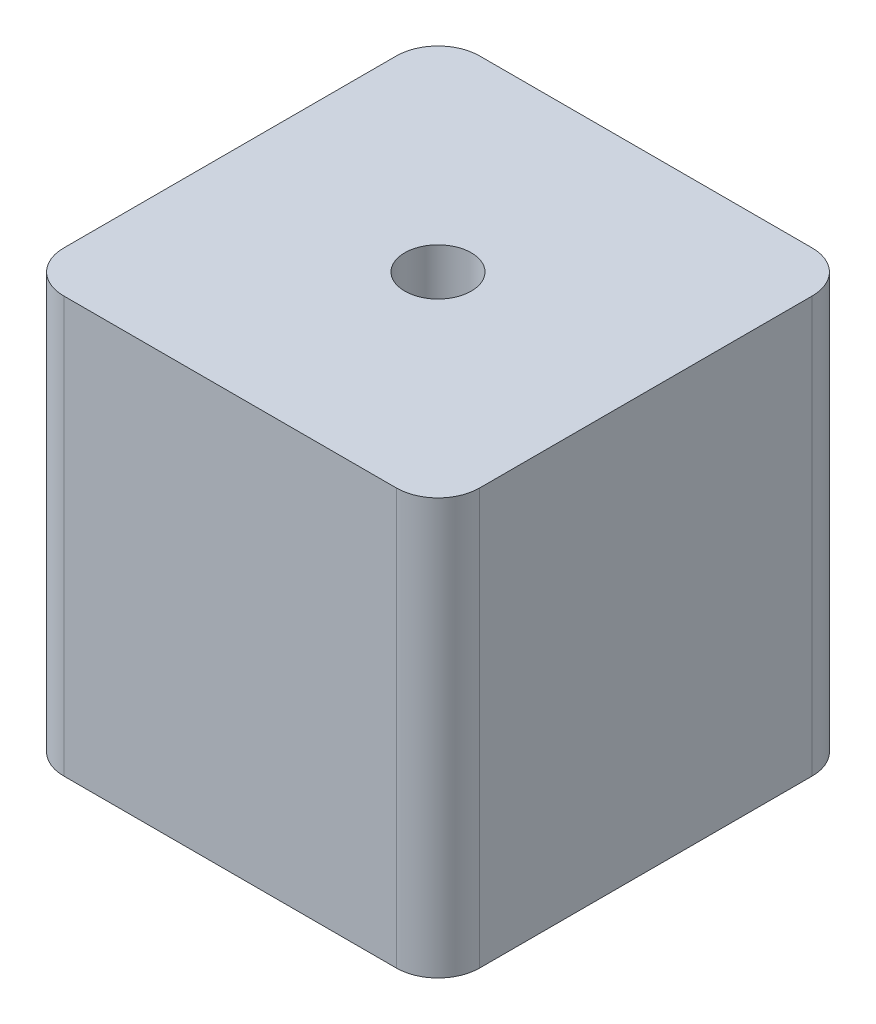
ISO-10303-21;
HEADER;
FILE_DESCRIPTION(('STEP AP214'),'2;1');
FILE_NAME('part.step','',(''),(''),'','','');
FILE_SCHEMA(('AUTOMOTIVE_DESIGN { 1 0 10303 214 1 1 1 1 }'));
ENDSEC;
DATA;
#1=APPLICATION_CONTEXT('core data for automotive mechanical design processes');
#2=APPLICATION_PROTOCOL_DEFINITION('international standard','automotive_design',2000,#1);
#3=PRODUCT_CONTEXT('',#1,'mechanical');
#4=PRODUCT('Part','Part','',(#3));
#5=PRODUCT_RELATED_PRODUCT_CATEGORY('part','',(#4));
#6=PRODUCT_DEFINITION_FORMATION('','',#4);
#7=PRODUCT_DEFINITION_CONTEXT('part definition',#1,'design');
#8=PRODUCT_DEFINITION('design','',#6,#7);
#9=PRODUCT_DEFINITION_SHAPE('','',#8);
#10=(LENGTH_UNIT() NAMED_UNIT(*) SI_UNIT(.MILLI.,.METRE.));
#11=(NAMED_UNIT(*) PLANE_ANGLE_UNIT() SI_UNIT($,.RADIAN.));
#12=(NAMED_UNIT(*) SI_UNIT($,.STERADIAN.) SOLID_ANGLE_UNIT());
#13=UNCERTAINTY_MEASURE_WITH_UNIT(LENGTH_MEASURE(1.E-05),#10,'distance_accuracy_value','');
#14=(GEOMETRIC_REPRESENTATION_CONTEXT(3) GLOBAL_UNCERTAINTY_ASSIGNED_CONTEXT((#13)) GLOBAL_UNIT_ASSIGNED_CONTEXT((#10,
#11,#12)) REPRESENTATION_CONTEXT('',''));
#15=CARTESIAN_POINT('',(0.,0.,0.));
#16=DIRECTION('',(0.,0.,1.));
#17=DIRECTION('',(1.,0.,0.));
#18=AXIS2_PLACEMENT_3D('',#15,#16,#17);
#19=CARTESIAN_POINT('',(0.,20.,0.));
#20=DIRECTION('',(0.,1.,0.));
#21=DIRECTION('',(0.,0.,1.));
#22=AXIS2_PLACEMENT_3D('',#19,#20,#21);
#23=PLANE('',#22);
#24=DIRECTION('',(-1.,0.,0.));
#25=VECTOR('',#24,1.);
#26=CARTESIAN_POINT('',(-10.,20.,-10.));
#27=LINE('',#26,#25);
#28=CARTESIAN_POINT('',(8.,20.,-10.));
#29=VERTEX_POINT('',#28);
#30=CARTESIAN_POINT('',(-8.,20.,-10.));
#31=VERTEX_POINT('',#30);
#32=EDGE_CURVE('E169',#29,#31,#27,.T.);
#33=ORIENTED_EDGE('',*,*,#32,.T.);
#34=CARTESIAN_POINT('',(-8.,20.,-8.));
#35=DIRECTION('',(0.,1.,0.));
#36=DIRECTION('',(0.,0.,1.));
#37=AXIS2_PLACEMENT_3D('',#34,#35,#36);
#38=CIRCLE('',#37,2.);
#39=CARTESIAN_POINT('',(-10.,20.,-8.));
#40=VERTEX_POINT('',#39);
#41=EDGE_CURVE('E150',#31,#40,#38,.T.);
#42=ORIENTED_EDGE('',*,*,#41,.T.);
#43=DIRECTION('',(0.,0.,1.));
#44=VECTOR('',#43,1.);
#45=CARTESIAN_POINT('',(-10.,20.,-10.));
#46=LINE('',#45,#44);
#47=CARTESIAN_POINT('',(-10.,20.,8.));
#48=VERTEX_POINT('',#47);
#49=EDGE_CURVE('E120',#40,#48,#46,.T.);
#50=ORIENTED_EDGE('',*,*,#49,.T.);
#51=CARTESIAN_POINT('',(-8.,20.,8.));
#52=DIRECTION('',(0.,1.,0.));
#53=DIRECTION('',(0.,0.,1.));
#54=AXIS2_PLACEMENT_3D('',#51,#52,#53);
#55=CIRCLE('',#54,2.);
#56=CARTESIAN_POINT('',(-8.,20.,10.));
#57=VERTEX_POINT('',#56);
#58=EDGE_CURVE('E56',#48,#57,#55,.T.);
#59=ORIENTED_EDGE('',*,*,#58,.T.);
#60=DIRECTION('',(1.,0.,0.));
#61=VECTOR('',#60,1.);
#62=CARTESIAN_POINT('',(-10.,20.,10.));
#63=LINE('',#62,#61);
#64=CARTESIAN_POINT('',(8.00000000000001,20.,10.));
#65=VERTEX_POINT('',#64);
#66=EDGE_CURVE('E136',#57,#65,#63,.T.);
#67=ORIENTED_EDGE('',*,*,#66,.T.);
#68=CARTESIAN_POINT('',(8.,20.,8.));
#69=DIRECTION('',(0.,1.,0.));
#70=DIRECTION('',(0.,0.,1.));
#71=AXIS2_PLACEMENT_3D('',#68,#69,#70);
#72=CIRCLE('',#71,2.);
#73=CARTESIAN_POINT('',(10.,20.,8.));
#74=VERTEX_POINT('',#73);
#75=EDGE_CURVE('E147',#65,#74,#72,.T.);
#76=ORIENTED_EDGE('',*,*,#75,.T.);
#77=DIRECTION('',(0.,0.,-1.));
#78=VECTOR('',#77,1.);
#79=CARTESIAN_POINT('',(10.,20.,-10.));
#80=LINE('',#79,#78);
#81=CARTESIAN_POINT('',(10.,20.,-8.));
#82=VERTEX_POINT('',#81);
#83=EDGE_CURVE('E130',#74,#82,#80,.T.);
#84=ORIENTED_EDGE('',*,*,#83,.T.);
#85=CARTESIAN_POINT('',(8.,20.,-8.));
#86=DIRECTION('',(0.,1.,0.));
#87=DIRECTION('',(0.,0.,1.));
#88=AXIS2_PLACEMENT_3D('',#85,#86,#87);
#89=CIRCLE('',#88,2.);
#90=EDGE_CURVE('E145',#82,#29,#89,.T.);
#91=ORIENTED_EDGE('',*,*,#90,.T.);
#92=EDGE_LOOP('',(#33,#42,#50,#59,#67,#76,#84,#91));
#93=FACE_BOUND('',#92,.T.);
#94=CARTESIAN_POINT('',(0.,20.,0.));
#95=DIRECTION('',(0.,1.,0.));
#96=DIRECTION('',(0.,0.,1.));
#97=AXIS2_PLACEMENT_3D('',#94,#95,#96);
#98=CIRCLE('',#97,1.6);
#99=CARTESIAN_POINT('',(0.,20.,1.6));
#100=VERTEX_POINT('',#99);
#101=EDGE_CURVE('E174',#100,#100,#98,.T.);
#102=ORIENTED_EDGE('',*,*,#101,.F.);
#103=EDGE_LOOP('',(#102));
#104=FACE_BOUND('',#103,.T.);
#105=ADVANCED_FACE('F34',(#93,#104),#23,.T.);
#106=CARTESIAN_POINT('',(0.,0.,0.));
#107=DIRECTION('',(0.,1.,0.));
#108=DIRECTION('',(0.,0.,1.));
#109=AXIS2_PLACEMENT_3D('',#106,#107,#108);
#110=PLANE('',#109);
#111=DIRECTION('',(0.,0.,1.));
#112=VECTOR('',#111,1.);
#113=CARTESIAN_POINT('',(-10.,0.,-10.));
#114=LINE('',#113,#112);
#115=CARTESIAN_POINT('',(-10.,0.,-8.));
#116=VERTEX_POINT('',#115);
#117=CARTESIAN_POINT('',(-10.,0.,8.));
#118=VERTEX_POINT('',#117);
#119=EDGE_CURVE('E118',#116,#118,#114,.T.);
#120=ORIENTED_EDGE('',*,*,#119,.F.);
#121=CARTESIAN_POINT('',(-8.,0.,-8.));
#122=DIRECTION('',(0.,1.,0.));
#123=DIRECTION('',(0.,0.,1.));
#124=AXIS2_PLACEMENT_3D('',#121,#122,#123);
#125=CIRCLE('',#124,2.);
#126=CARTESIAN_POINT('',(-8.,0.,-10.));
#127=VERTEX_POINT('',#126);
#128=EDGE_CURVE('E101',#116,#127,#125,.F.);
#129=ORIENTED_EDGE('',*,*,#128,.T.);
#130=DIRECTION('',(-1.,0.,0.));
#131=VECTOR('',#130,1.);
#132=CARTESIAN_POINT('',(-10.,0.,-10.));
#133=LINE('',#132,#131);
#134=CARTESIAN_POINT('',(8.,0.,-10.));
#135=VERTEX_POINT('',#134);
#136=EDGE_CURVE('E128',#135,#127,#133,.T.);
#137=ORIENTED_EDGE('',*,*,#136,.F.);
#138=CARTESIAN_POINT('',(8.,0.,-8.));
#139=DIRECTION('',(0.,1.,0.));
#140=DIRECTION('',(0.,0.,1.));
#141=AXIS2_PLACEMENT_3D('',#138,#139,#140);
#142=CIRCLE('',#141,2.);
#143=CARTESIAN_POINT('',(10.,0.,-8.));
#144=VERTEX_POINT('',#143);
#145=EDGE_CURVE('E121',#135,#144,#142,.F.);
#146=ORIENTED_EDGE('',*,*,#145,.T.);
#147=DIRECTION('',(0.,0.,-1.));
#148=VECTOR('',#147,1.);
#149=CARTESIAN_POINT('',(10.,0.,-10.));
#150=LINE('',#149,#148);
#151=CARTESIAN_POINT('',(10.,0.,8.));
#152=VERTEX_POINT('',#151);
#153=EDGE_CURVE('E132',#152,#144,#150,.T.);
#154=ORIENTED_EDGE('',*,*,#153,.F.);
#155=CARTESIAN_POINT('',(8.,0.,8.));
#156=DIRECTION('',(0.,1.,0.));
#157=DIRECTION('',(0.,0.,1.));
#158=AXIS2_PLACEMENT_3D('',#155,#156,#157);
#159=CIRCLE('',#158,2.);
#160=CARTESIAN_POINT('',(8.00000000000001,0.,10.));
#161=VERTEX_POINT('',#160);
#162=EDGE_CURVE('E139',#152,#161,#159,.F.);
#163=ORIENTED_EDGE('',*,*,#162,.T.);
#164=DIRECTION('',(1.,0.,0.));
#165=VECTOR('',#164,1.);
#166=CARTESIAN_POINT('',(-10.,0.,10.));
#167=LINE('',#166,#165);
#168=CARTESIAN_POINT('',(-8.,0.,10.));
#169=VERTEX_POINT('',#168);
#170=EDGE_CURVE('E127',#169,#161,#167,.T.);
#171=ORIENTED_EDGE('',*,*,#170,.F.);
#172=CARTESIAN_POINT('',(-8.,0.,8.));
#173=DIRECTION('',(0.,1.,0.));
#174=DIRECTION('',(0.,0.,1.));
#175=AXIS2_PLACEMENT_3D('',#172,#173,#174);
#176=CIRCLE('',#175,2.);
#177=EDGE_CURVE('E112',#169,#118,#176,.F.);
#178=ORIENTED_EDGE('',*,*,#177,.T.);
#179=EDGE_LOOP('',(#120,#129,#137,#146,#154,#163,#171,#178));
#180=FACE_BOUND('',#179,.T.);
#181=CARTESIAN_POINT('',(0.,0.,0.));
#182=DIRECTION('',(0.,1.,0.));
#183=DIRECTION('',(0.,0.,1.));
#184=AXIS2_PLACEMENT_3D('',#181,#182,#183);
#185=CIRCLE('',#184,1.6);
#186=CARTESIAN_POINT('',(0.,0.,1.6));
#187=VERTEX_POINT('',#186);
#188=EDGE_CURVE('E176',#187,#187,#185,.T.);
#189=ORIENTED_EDGE('',*,*,#188,.T.);
#190=EDGE_LOOP('',(#189));
#191=FACE_BOUND('',#190,.T.);
#192=ADVANCED_FACE('F124',(#180,#191),#110,.F.);
#193=CARTESIAN_POINT('',(10.,20.,-10.));
#194=DIRECTION('',(-1.,0.,0.));
#195=DIRECTION('',(0.,0.,1.));
#196=AXIS2_PLACEMENT_3D('',#193,#194,#195);
#197=PLANE('',#196);
#198=ORIENTED_EDGE('',*,*,#83,.F.);
#199=DIRECTION('',(0.,-1.,0.));
#200=VECTOR('',#199,1.);
#201=CARTESIAN_POINT('',(10.,20.,8.));
#202=LINE('',#201,#200);
#203=EDGE_CURVE('E11',#74,#152,#202,.T.);
#204=ORIENTED_EDGE('',*,*,#203,.T.);
#205=ORIENTED_EDGE('',*,*,#153,.T.);
#206=DIRECTION('',(0.,-1.,0.));
#207=VECTOR('',#206,1.);
#208=CARTESIAN_POINT('',(10.,20.,-8.));
#209=LINE('',#208,#207);
#210=EDGE_CURVE('E42',#144,#82,#209,.F.);
#211=ORIENTED_EDGE('',*,*,#210,.T.);
#212=EDGE_LOOP('',(#198,#204,#205,#211));
#213=FACE_BOUND('',#212,.T.);
#214=ADVANCED_FACE('F160',(#213),#197,.F.);
#215=CARTESIAN_POINT('',(-10.,20.,-10.));
#216=DIRECTION('',(0.,0.,1.));
#217=DIRECTION('',(1.,0.,0.));
#218=AXIS2_PLACEMENT_3D('',#215,#216,#217);
#219=PLANE('',#218);
#220=ORIENTED_EDGE('',*,*,#136,.T.);
#221=DIRECTION('',(0.,-1.,0.));
#222=VECTOR('',#221,1.);
#223=CARTESIAN_POINT('',(-8.,20.,-10.));
#224=LINE('',#223,#222);
#225=EDGE_CURVE('E106',#127,#31,#224,.F.);
#226=ORIENTED_EDGE('',*,*,#225,.T.);
#227=ORIENTED_EDGE('',*,*,#32,.F.);
#228=DIRECTION('',(0.,-1.,0.));
#229=VECTOR('',#228,1.);
#230=CARTESIAN_POINT('',(8.,20.,-10.));
#231=LINE('',#230,#229);
#232=EDGE_CURVE('E111',#29,#135,#231,.T.);
#233=ORIENTED_EDGE('',*,*,#232,.T.);
#234=EDGE_LOOP('',(#220,#226,#227,#233));
#235=FACE_BOUND('',#234,.T.);
#236=ADVANCED_FACE('F173',(#235),#219,.F.);
#237=CARTESIAN_POINT('',(-10.,20.,-10.));
#238=DIRECTION('',(1.,0.,0.));
#239=DIRECTION('',(0.,0.,-1.));
#240=AXIS2_PLACEMENT_3D('',#237,#238,#239);
#241=PLANE('',#240);
#242=ORIENTED_EDGE('',*,*,#49,.F.);
#243=DIRECTION('',(0.,-1.,0.));
#244=VECTOR('',#243,1.);
#245=CARTESIAN_POINT('',(-10.,20.,-8.));
#246=LINE('',#245,#244);
#247=EDGE_CURVE('E105',#40,#116,#246,.T.);
#248=ORIENTED_EDGE('',*,*,#247,.T.);
#249=ORIENTED_EDGE('',*,*,#119,.T.);
#250=DIRECTION('',(0.,-1.,0.));
#251=VECTOR('',#250,1.);
#252=CARTESIAN_POINT('',(-10.,20.,8.));
#253=LINE('',#252,#251);
#254=EDGE_CURVE('E122',#118,#48,#253,.F.);
#255=ORIENTED_EDGE('',*,*,#254,.T.);
#256=EDGE_LOOP('',(#242,#248,#249,#255));
#257=FACE_BOUND('',#256,.T.);
#258=ADVANCED_FACE('F117',(#257),#241,.F.);
#259=CARTESIAN_POINT('',(-10.,20.,10.));
#260=DIRECTION('',(0.,0.,-1.));
#261=DIRECTION('',(-1.,0.,0.));
#262=AXIS2_PLACEMENT_3D('',#259,#260,#261);
#263=PLANE('',#262);
#264=ORIENTED_EDGE('',*,*,#66,.F.);
#265=DIRECTION('',(0.,-1.,0.));
#266=VECTOR('',#265,1.);
#267=CARTESIAN_POINT('',(-8.,20.,10.));
#268=LINE('',#267,#266);
#269=EDGE_CURVE('E153',#57,#169,#268,.T.);
#270=ORIENTED_EDGE('',*,*,#269,.T.);
#271=ORIENTED_EDGE('',*,*,#170,.T.);
#272=DIRECTION('',(0.,-1.,0.));
#273=VECTOR('',#272,1.);
#274=CARTESIAN_POINT('',(8.00000000000001,20.,10.));
#275=LINE('',#274,#273);
#276=EDGE_CURVE('E49',#161,#65,#275,.F.);
#277=ORIENTED_EDGE('',*,*,#276,.T.);
#278=EDGE_LOOP('',(#264,#270,#271,#277));
#279=FACE_BOUND('',#278,.T.);
#280=ADVANCED_FACE('F187',(#279),#263,.F.);
#281=CARTESIAN_POINT('',(0.,20.,0.));
#282=DIRECTION('',(0.,-1.,0.));
#283=DIRECTION('',(0.,0.,-1.));
#284=AXIS2_PLACEMENT_3D('',#281,#282,#283);
#285=CYLINDRICAL_SURFACE('',#284,1.6);
#286=ORIENTED_EDGE('',*,*,#101,.T.);
#287=EDGE_LOOP('',(#286));
#288=FACE_BOUND('',#287,.T.);
#289=ORIENTED_EDGE('',*,*,#188,.F.);
#290=EDGE_LOOP('',(#289));
#291=FACE_BOUND('',#290,.T.);
#292=ADVANCED_FACE('F185',(#288,#291),#285,.F.);
#293=CARTESIAN_POINT('',(-8.,20.,-8.));
#294=DIRECTION('',(0.,-1.,0.));
#295=DIRECTION('',(0.,0.,-1.));
#296=AXIS2_PLACEMENT_3D('',#293,#294,#295);
#297=CYLINDRICAL_SURFACE('',#296,2.);
#298=ORIENTED_EDGE('',*,*,#41,.F.);
#299=ORIENTED_EDGE('',*,*,#225,.F.);
#300=ORIENTED_EDGE('',*,*,#128,.F.);
#301=ORIENTED_EDGE('',*,*,#247,.F.);
#302=EDGE_LOOP('',(#298,#299,#300,#301));
#303=FACE_BOUND('',#302,.T.);
#304=ADVANCED_FACE('F104',(#303),#297,.T.);
#305=CARTESIAN_POINT('',(-8.,20.,8.));
#306=DIRECTION('',(0.,-1.,0.));
#307=DIRECTION('',(0.,0.,-1.));
#308=AXIS2_PLACEMENT_3D('',#305,#306,#307);
#309=CYLINDRICAL_SURFACE('',#308,2.);
#310=ORIENTED_EDGE('',*,*,#58,.F.);
#311=ORIENTED_EDGE('',*,*,#254,.F.);
#312=ORIENTED_EDGE('',*,*,#177,.F.);
#313=ORIENTED_EDGE('',*,*,#269,.F.);
#314=EDGE_LOOP('',(#310,#311,#312,#313));
#315=FACE_BOUND('',#314,.T.);
#316=ADVANCED_FACE('F194',(#315),#309,.T.);
#317=CARTESIAN_POINT('',(8.,20.,8.));
#318=DIRECTION('',(0.,-1.,0.));
#319=DIRECTION('',(0.,0.,-1.));
#320=AXIS2_PLACEMENT_3D('',#317,#318,#319);
#321=CYLINDRICAL_SURFACE('',#320,2.);
#322=ORIENTED_EDGE('',*,*,#75,.F.);
#323=ORIENTED_EDGE('',*,*,#276,.F.);
#324=ORIENTED_EDGE('',*,*,#162,.F.);
#325=ORIENTED_EDGE('',*,*,#203,.F.);
#326=EDGE_LOOP('',(#322,#323,#324,#325));
#327=FACE_BOUND('',#326,.T.);
#328=ADVANCED_FACE('F211',(#327),#321,.T.);
#329=CARTESIAN_POINT('',(8.,20.,-8.));
#330=DIRECTION('',(0.,-1.,0.));
#331=DIRECTION('',(0.,0.,-1.));
#332=AXIS2_PLACEMENT_3D('',#329,#330,#331);
#333=CYLINDRICAL_SURFACE('',#332,2.);
#334=ORIENTED_EDGE('',*,*,#90,.F.);
#335=ORIENTED_EDGE('',*,*,#210,.F.);
#336=ORIENTED_EDGE('',*,*,#145,.F.);
#337=ORIENTED_EDGE('',*,*,#232,.F.);
#338=EDGE_LOOP('',(#334,#335,#336,#337));
#339=FACE_BOUND('',#338,.T.);
#340=ADVANCED_FACE('F36',(#339),#333,.T.);
#341=CLOSED_SHELL('',(#105,#192,#214,#236,#258,#280,#292,#304,#316,#328,#340));
#342=MANIFOLD_SOLID_BREP('B2',#341);
#343=ADVANCED_BREP_SHAPE_REPRESENTATION('',(#18,#342),#14);
#344=SHAPE_DEFINITION_REPRESENTATION(#9,#343);
ENDSEC;
END-ISO-10303-21;
